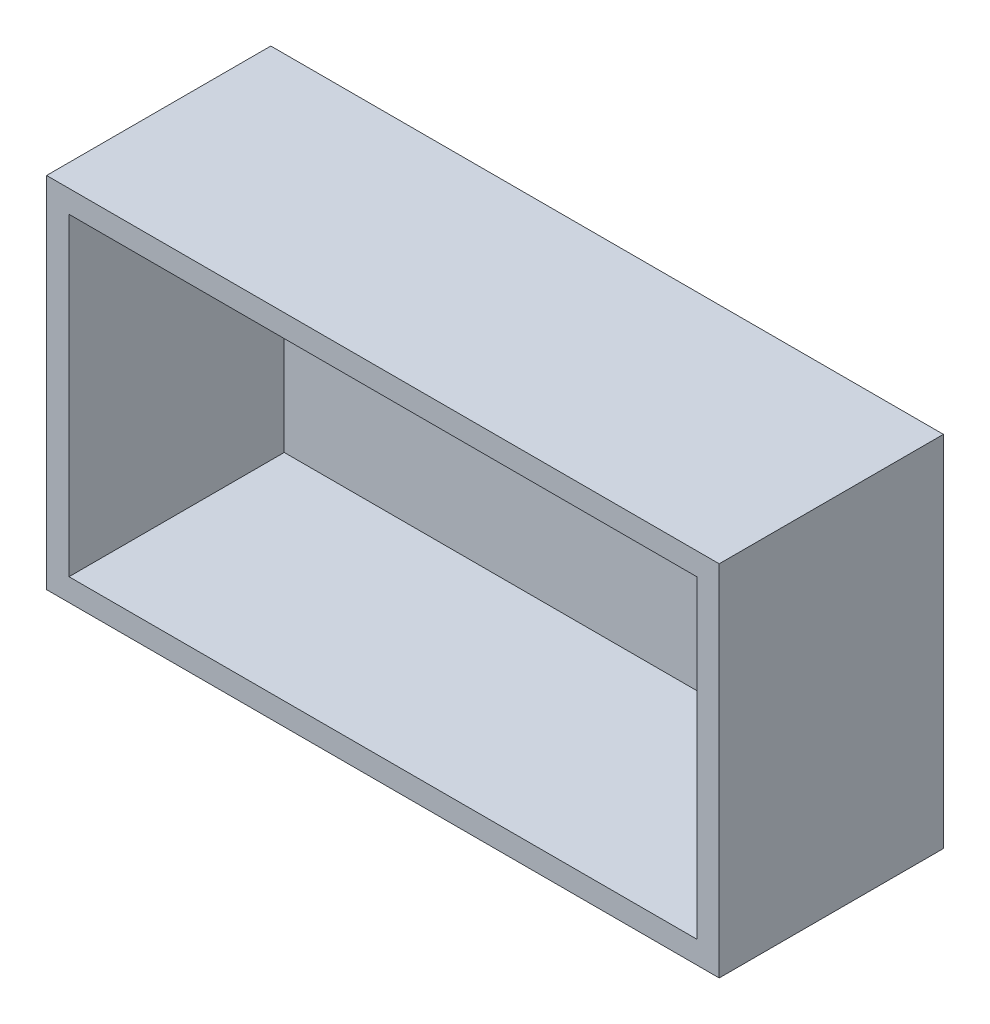
ISO-10303-21;
HEADER;
FILE_DESCRIPTION(('STEP AP214'),'2;1');
FILE_NAME('part.step','',(''),(''),'','','');
FILE_SCHEMA(('AUTOMOTIVE_DESIGN { 1 0 10303 214 1 1 1 1 }'));
ENDSEC;
DATA;
#1=APPLICATION_CONTEXT('core data for automotive mechanical design processes');
#2=APPLICATION_PROTOCOL_DEFINITION('international standard','automotive_design',2000,#1);
#3=PRODUCT_CONTEXT('',#1,'mechanical');
#4=PRODUCT('Part','Part','',(#3));
#5=PRODUCT_RELATED_PRODUCT_CATEGORY('part','',(#4));
#6=PRODUCT_DEFINITION_FORMATION('','',#4);
#7=PRODUCT_DEFINITION_CONTEXT('part definition',#1,'design');
#8=PRODUCT_DEFINITION('design','',#6,#7);
#9=PRODUCT_DEFINITION_SHAPE('','',#8);
#10=(LENGTH_UNIT() NAMED_UNIT(*) SI_UNIT(.MILLI.,.METRE.));
#11=(NAMED_UNIT(*) PLANE_ANGLE_UNIT() SI_UNIT($,.RADIAN.));
#12=(NAMED_UNIT(*) SI_UNIT($,.STERADIAN.) SOLID_ANGLE_UNIT());
#13=UNCERTAINTY_MEASURE_WITH_UNIT(LENGTH_MEASURE(1.E-05),#10,'distance_accuracy_value','');
#14=(GEOMETRIC_REPRESENTATION_CONTEXT(3) GLOBAL_UNCERTAINTY_ASSIGNED_CONTEXT((#13)) GLOBAL_UNIT_ASSIGNED_CONTEXT((#10,
#11,#12)) REPRESENTATION_CONTEXT('',''));
#15=CARTESIAN_POINT('',(0.,0.,0.));
#16=DIRECTION('',(0.,0.,1.));
#17=DIRECTION('',(1.,0.,0.));
#18=AXIS2_PLACEMENT_3D('',#15,#16,#17);
#19=CARTESIAN_POINT('',(-78.9556962025317,10.126582278481,50.));
#20=DIRECTION('',(1.,0.,0.));
#21=DIRECTION('',(0.,1.,0.));
#22=AXIS2_PLACEMENT_3D('',#19,#20,#21);
#23=PLANE('',#22);
#24=DIRECTION('',(0.,-1.,0.));
#25=VECTOR('',#24,1.);
#26=CARTESIAN_POINT('',(-78.9556962025317,10.126582278481,0.));
#27=LINE('',#26,#25);
#28=CARTESIAN_POINT('',(-78.9556962025317,10.126582278481,0.));
#29=VERTEX_POINT('',#28);
#30=CARTESIAN_POINT('',(-78.9556962025317,-69.873417721519,0.));
#31=VERTEX_POINT('',#30);
#32=EDGE_CURVE('E145',#29,#31,#27,.T.);
#33=ORIENTED_EDGE('',*,*,#32,.T.);
#34=DIRECTION('',(0.,0.,-1.));
#35=VECTOR('',#34,1.);
#36=CARTESIAN_POINT('',(-78.9556962025317,-69.873417721519,50.));
#37=LINE('',#36,#35);
#38=CARTESIAN_POINT('',(-78.9556962025317,-69.873417721519,50.));
#39=VERTEX_POINT('',#38);
#40=EDGE_CURVE('E11',#39,#31,#37,.T.);
#41=ORIENTED_EDGE('',*,*,#40,.F.);
#42=DIRECTION('',(0.,-1.,0.));
#43=VECTOR('',#42,1.);
#44=CARTESIAN_POINT('',(-78.9556962025317,10.126582278481,50.));
#45=LINE('',#44,#43);
#46=CARTESIAN_POINT('',(-78.9556962025317,10.126582278481,50.));
#47=VERTEX_POINT('',#46);
#48=EDGE_CURVE('E149',#47,#39,#45,.T.);
#49=ORIENTED_EDGE('',*,*,#48,.F.);
#50=DIRECTION('',(0.,0.,-1.));
#51=VECTOR('',#50,1.);
#52=CARTESIAN_POINT('',(-78.9556962025317,10.126582278481,50.));
#53=LINE('',#52,#51);
#54=EDGE_CURVE('E155',#47,#29,#53,.T.);
#55=ORIENTED_EDGE('',*,*,#54,.T.);
#56=EDGE_LOOP('',(#33,#41,#49,#55));
#57=FACE_BOUND('',#56,.T.);
#58=ADVANCED_FACE('F37',(#57),#23,.F.);
#59=CARTESIAN_POINT('',(-78.9556962025317,-69.873417721519,50.));
#60=DIRECTION('',(0.,1.,0.));
#61=DIRECTION('',(0.,0.,1.));
#62=AXIS2_PLACEMENT_3D('',#59,#60,#61);
#63=PLANE('',#62);
#64=DIRECTION('',(1.,0.,0.));
#65=VECTOR('',#64,1.);
#66=CARTESIAN_POINT('',(-78.9556962025317,-69.873417721519,0.));
#67=LINE('',#66,#65);
#68=CARTESIAN_POINT('',(71.0443037974683,-69.873417721519,0.));
#69=VERTEX_POINT('',#68);
#70=EDGE_CURVE('E158',#31,#69,#67,.T.);
#71=ORIENTED_EDGE('',*,*,#70,.T.);
#72=DIRECTION('',(0.,0.,-1.));
#73=VECTOR('',#72,1.);
#74=CARTESIAN_POINT('',(71.0443037974683,-69.873417721519,50.));
#75=LINE('',#74,#73);
#76=CARTESIAN_POINT('',(71.0443037974683,-69.873417721519,50.));
#77=VERTEX_POINT('',#76);
#78=EDGE_CURVE('E44',#77,#69,#75,.T.);
#79=ORIENTED_EDGE('',*,*,#78,.F.);
#80=DIRECTION('',(1.,0.,0.));
#81=VECTOR('',#80,1.);
#82=CARTESIAN_POINT('',(-78.9556962025317,-69.873417721519,50.));
#83=LINE('',#82,#81);
#84=EDGE_CURVE('E88',#39,#77,#83,.T.);
#85=ORIENTED_EDGE('',*,*,#84,.F.);
#86=ORIENTED_EDGE('',*,*,#40,.T.);
#87=EDGE_LOOP('',(#71,#79,#85,#86));
#88=FACE_BOUND('',#87,.T.);
#89=ADVANCED_FACE('F187',(#88),#63,.F.);
#90=CARTESIAN_POINT('',(71.0443037974683,10.126582278481,50.));
#91=DIRECTION('',(-1.,0.,0.));
#92=DIRECTION('',(0.,-1.,0.));
#93=AXIS2_PLACEMENT_3D('',#90,#91,#92);
#94=PLANE('',#93);
#95=DIRECTION('',(0.,1.,0.));
#96=VECTOR('',#95,1.);
#97=CARTESIAN_POINT('',(71.0443037974683,10.126582278481,0.));
#98=LINE('',#97,#96);
#99=CARTESIAN_POINT('',(71.0443037974683,10.126582278481,0.));
#100=VERTEX_POINT('',#99);
#101=EDGE_CURVE('E160',#69,#100,#98,.T.);
#102=ORIENTED_EDGE('',*,*,#101,.T.);
#103=DIRECTION('',(0.,0.,-1.));
#104=VECTOR('',#103,1.);
#105=CARTESIAN_POINT('',(71.0443037974683,10.126582278481,50.));
#106=LINE('',#105,#104);
#107=CARTESIAN_POINT('',(71.0443037974683,10.126582278481,50.));
#108=VERTEX_POINT('',#107);
#109=EDGE_CURVE('E164',#108,#100,#106,.T.);
#110=ORIENTED_EDGE('',*,*,#109,.F.);
#111=DIRECTION('',(0.,1.,0.));
#112=VECTOR('',#111,1.);
#113=CARTESIAN_POINT('',(71.0443037974683,10.126582278481,50.));
#114=LINE('',#113,#112);
#115=EDGE_CURVE('E152',#77,#108,#114,.T.);
#116=ORIENTED_EDGE('',*,*,#115,.F.);
#117=ORIENTED_EDGE('',*,*,#78,.T.);
#118=EDGE_LOOP('',(#102,#110,#116,#117));
#119=FACE_BOUND('',#118,.T.);
#120=ADVANCED_FACE('F169',(#119),#94,.F.);
#121=CARTESIAN_POINT('',(-78.9556962025317,10.126582278481,50.));
#122=DIRECTION('',(0.,-1.,0.));
#123=DIRECTION('',(0.,0.,-1.));
#124=AXIS2_PLACEMENT_3D('',#121,#122,#123);
#125=PLANE('',#124);
#126=DIRECTION('',(-1.,0.,0.));
#127=VECTOR('',#126,1.);
#128=CARTESIAN_POINT('',(-78.9556962025317,10.126582278481,0.));
#129=LINE('',#128,#127);
#130=EDGE_CURVE('E81',#100,#29,#129,.T.);
#131=ORIENTED_EDGE('',*,*,#130,.T.);
#132=ORIENTED_EDGE('',*,*,#54,.F.);
#133=DIRECTION('',(-1.,0.,0.));
#134=VECTOR('',#133,1.);
#135=CARTESIAN_POINT('',(-78.9556962025317,10.126582278481,50.));
#136=LINE('',#135,#134);
#137=EDGE_CURVE('E60',#108,#47,#136,.T.);
#138=ORIENTED_EDGE('',*,*,#137,.F.);
#139=ORIENTED_EDGE('',*,*,#109,.T.);
#140=EDGE_LOOP('',(#131,#132,#138,#139));
#141=FACE_BOUND('',#140,.T.);
#142=ADVANCED_FACE('F177',(#141),#125,.F.);
#143=CARTESIAN_POINT('',(0.,0.,50.));
#144=DIRECTION('',(0.,0.,1.));
#145=DIRECTION('',(1.,0.,0.));
#146=AXIS2_PLACEMENT_3D('',#143,#144,#145);
#147=PLANE('',#146);
#148=DIRECTION('',(0.,1.,0.));
#149=VECTOR('',#148,1.);
#150=CARTESIAN_POINT('',(66.0443037974683,-64.873417721519,50.));
#151=LINE('',#150,#149);
#152=CARTESIAN_POINT('',(66.0443037974683,-64.873417721519,50.));
#153=VERTEX_POINT('',#152);
#154=CARTESIAN_POINT('',(66.0443037974683,5.126582278481,50.));
#155=VERTEX_POINT('',#154);
#156=EDGE_CURVE('E51',#153,#155,#151,.T.);
#157=ORIENTED_EDGE('',*,*,#156,.F.);
#158=DIRECTION('',(1.,0.,0.));
#159=VECTOR('',#158,1.);
#160=CARTESIAN_POINT('',(66.0443037974683,-64.873417721519,50.));
#161=LINE('',#160,#159);
#162=CARTESIAN_POINT('',(-73.9556962025317,-64.873417721519,50.));
#163=VERTEX_POINT('',#162);
#164=EDGE_CURVE('E130',#163,#153,#161,.T.);
#165=ORIENTED_EDGE('',*,*,#164,.F.);
#166=DIRECTION('',(0.,-1.,0.));
#167=VECTOR('',#166,1.);
#168=CARTESIAN_POINT('',(-73.9556962025317,-64.873417721519,50.));
#169=LINE('',#168,#167);
#170=CARTESIAN_POINT('',(-73.9556962025317,5.12658227848098,50.));
#171=VERTEX_POINT('',#170);
#172=EDGE_CURVE('E133',#171,#163,#169,.T.);
#173=ORIENTED_EDGE('',*,*,#172,.F.);
#174=DIRECTION('',(-1.,0.,0.));
#175=VECTOR('',#174,1.);
#176=CARTESIAN_POINT('',(66.0443037974683,5.126582278481,50.));
#177=LINE('',#176,#175);
#178=EDGE_CURVE('E139',#155,#171,#177,.T.);
#179=ORIENTED_EDGE('',*,*,#178,.F.);
#180=EDGE_LOOP('',(#157,#165,#173,#179));
#181=FACE_BOUND('',#180,.T.);
#182=ORIENTED_EDGE('',*,*,#48,.T.);
#183=ORIENTED_EDGE('',*,*,#84,.T.);
#184=ORIENTED_EDGE('',*,*,#115,.T.);
#185=ORIENTED_EDGE('',*,*,#137,.T.);
#186=EDGE_LOOP('',(#182,#183,#184,#185));
#187=FACE_BOUND('',#186,.T.);
#188=ADVANCED_FACE('F179',(#181,#187),#147,.T.);
#189=CARTESIAN_POINT('',(0.,0.,0.));
#190=DIRECTION('',(0.,0.,1.));
#191=DIRECTION('',(1.,0.,0.));
#192=AXIS2_PLACEMENT_3D('',#189,#190,#191);
#193=PLANE('',#192);
#194=ORIENTED_EDGE('',*,*,#32,.F.);
#195=ORIENTED_EDGE('',*,*,#130,.F.);
#196=ORIENTED_EDGE('',*,*,#101,.F.);
#197=ORIENTED_EDGE('',*,*,#70,.F.);
#198=EDGE_LOOP('',(#194,#195,#196,#197));
#199=FACE_BOUND('',#198,.T.);
#200=ADVANCED_FACE('F173',(#199),#193,.F.);
#201=CARTESIAN_POINT('',(66.0443037974683,-64.873417721519,2.00000000000001));
#202=DIRECTION('',(1.,0.,0.));
#203=DIRECTION('',(0.,0.,-1.));
#204=AXIS2_PLACEMENT_3D('',#201,#202,#203);
#205=PLANE('',#204);
#206=ORIENTED_EDGE('',*,*,#156,.T.);
#207=DIRECTION('',(0.,0.,1.));
#208=VECTOR('',#207,1.);
#209=CARTESIAN_POINT('',(66.0443037974683,5.126582278481,2.00000000000001));
#210=LINE('',#209,#208);
#211=CARTESIAN_POINT('',(66.0443037974683,5.126582278481,2.00000000000001));
#212=VERTEX_POINT('',#211);
#213=EDGE_CURVE('E108',#212,#155,#210,.T.);
#214=ORIENTED_EDGE('',*,*,#213,.F.);
#215=DIRECTION('',(0.,1.,0.));
#216=VECTOR('',#215,1.);
#217=CARTESIAN_POINT('',(66.0443037974683,-64.873417721519,2.00000000000001));
#218=LINE('',#217,#216);
#219=CARTESIAN_POINT('',(66.0443037974683,-64.873417721519,2.00000000000001));
#220=VERTEX_POINT('',#219);
#221=EDGE_CURVE('E112',#220,#212,#218,.T.);
#222=ORIENTED_EDGE('',*,*,#221,.F.);
#223=DIRECTION('',(0.,0.,1.));
#224=VECTOR('',#223,1.);
#225=CARTESIAN_POINT('',(66.0443037974683,-64.873417721519,2.00000000000001));
#226=LINE('',#225,#224);
#227=EDGE_CURVE('E143',#220,#153,#226,.T.);
#228=ORIENTED_EDGE('',*,*,#227,.T.);
#229=EDGE_LOOP('',(#206,#214,#222,#228));
#230=FACE_BOUND('',#229,.T.);
#231=ADVANCED_FACE('F110',(#230),#205,.F.);
#232=CARTESIAN_POINT('',(66.0443037974683,-64.873417721519,2.00000000000001));
#233=DIRECTION('',(0.,-1.,0.));
#234=DIRECTION('',(1.,0.,0.));
#235=AXIS2_PLACEMENT_3D('',#232,#233,#234);
#236=PLANE('',#235);
#237=ORIENTED_EDGE('',*,*,#164,.T.);
#238=ORIENTED_EDGE('',*,*,#227,.F.);
#239=DIRECTION('',(1.,0.,0.));
#240=VECTOR('',#239,1.);
#241=CARTESIAN_POINT('',(66.0443037974683,-64.873417721519,2.00000000000001));
#242=LINE('',#241,#240);
#243=CARTESIAN_POINT('',(-73.9556962025317,-64.873417721519,2.00000000000001));
#244=VERTEX_POINT('',#243);
#245=EDGE_CURVE('E118',#244,#220,#242,.T.);
#246=ORIENTED_EDGE('',*,*,#245,.F.);
#247=DIRECTION('',(0.,0.,1.));
#248=VECTOR('',#247,1.);
#249=CARTESIAN_POINT('',(-73.9556962025317,-64.873417721519,2.00000000000001));
#250=LINE('',#249,#248);
#251=EDGE_CURVE('E146',#244,#163,#250,.T.);
#252=ORIENTED_EDGE('',*,*,#251,.T.);
#253=EDGE_LOOP('',(#237,#238,#246,#252));
#254=FACE_BOUND('',#253,.T.);
#255=ADVANCED_FACE('F226',(#254),#236,.F.);
#256=CARTESIAN_POINT('',(-73.9556962025317,-64.873417721519,2.00000000000001));
#257=DIRECTION('',(-1.,0.,0.));
#258=DIRECTION('',(0.,0.,1.));
#259=AXIS2_PLACEMENT_3D('',#256,#257,#258);
#260=PLANE('',#259);
#261=ORIENTED_EDGE('',*,*,#172,.T.);
#262=ORIENTED_EDGE('',*,*,#251,.F.);
#263=DIRECTION('',(0.,-1.,0.));
#264=VECTOR('',#263,1.);
#265=CARTESIAN_POINT('',(-73.9556962025317,-64.873417721519,2.00000000000001));
#266=LINE('',#265,#264);
#267=CARTESIAN_POINT('',(-73.9556962025317,5.12658227848098,2.00000000000001));
#268=VERTEX_POINT('',#267);
#269=EDGE_CURVE('E126',#268,#244,#266,.T.);
#270=ORIENTED_EDGE('',*,*,#269,.F.);
#271=DIRECTION('',(0.,0.,1.));
#272=VECTOR('',#271,1.);
#273=CARTESIAN_POINT('',(-73.9556962025317,5.12658227848098,2.00000000000001));
#274=LINE('',#273,#272);
#275=EDGE_CURVE('E117',#268,#171,#274,.T.);
#276=ORIENTED_EDGE('',*,*,#275,.T.);
#277=EDGE_LOOP('',(#261,#262,#270,#276));
#278=FACE_BOUND('',#277,.T.);
#279=ADVANCED_FACE('F235',(#278),#260,.F.);
#280=CARTESIAN_POINT('',(66.0443037974683,5.126582278481,2.00000000000001));
#281=DIRECTION('',(0.,1.,0.));
#282=DIRECTION('',(-1.,0.,0.));
#283=AXIS2_PLACEMENT_3D('',#280,#281,#282);
#284=PLANE('',#283);
#285=ORIENTED_EDGE('',*,*,#178,.T.);
#286=ORIENTED_EDGE('',*,*,#275,.F.);
#287=DIRECTION('',(-1.,0.,0.));
#288=VECTOR('',#287,1.);
#289=CARTESIAN_POINT('',(66.0443037974683,5.126582278481,2.00000000000001));
#290=LINE('',#289,#288);
#291=EDGE_CURVE('E121',#212,#268,#290,.T.);
#292=ORIENTED_EDGE('',*,*,#291,.F.);
#293=ORIENTED_EDGE('',*,*,#213,.T.);
#294=EDGE_LOOP('',(#285,#286,#292,#293));
#295=FACE_BOUND('',#294,.T.);
#296=ADVANCED_FACE('F122',(#295),#284,.F.);
#297=CARTESIAN_POINT('',(0.,0.,2.00000000000001));
#298=DIRECTION('',(0.,0.,1.));
#299=DIRECTION('',(1.,0.,0.));
#300=AXIS2_PLACEMENT_3D('',#297,#298,#299);
#301=PLANE('',#300);
#302=ORIENTED_EDGE('',*,*,#221,.T.);
#303=ORIENTED_EDGE('',*,*,#291,.T.);
#304=ORIENTED_EDGE('',*,*,#269,.T.);
#305=ORIENTED_EDGE('',*,*,#245,.T.);
#306=EDGE_LOOP('',(#302,#303,#304,#305));
#307=FACE_BOUND('',#306,.T.);
#308=ADVANCED_FACE('F128',(#307),#301,.T.);
#309=CLOSED_SHELL('',(#58,#89,#120,#142,#188,#200,#231,#255,#279,#296,#308));
#310=MANIFOLD_SOLID_BREP('B2',#309);
#311=ADVANCED_BREP_SHAPE_REPRESENTATION('',(#18,#310),#14);
#312=SHAPE_DEFINITION_REPRESENTATION(#9,#311);
ENDSEC;
END-ISO-10303-21;
